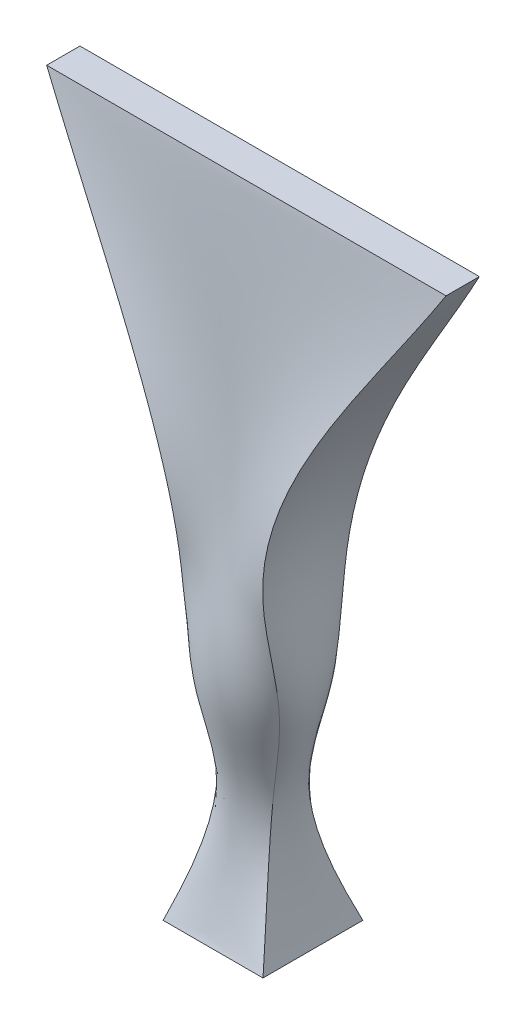
ISO-10303-21;
HEADER;
FILE_DESCRIPTION(('STEP AP214'),'2;1');
FILE_NAME('part.step','',(''),(''),'','','');
FILE_SCHEMA(('AUTOMOTIVE_DESIGN { 1 0 10303 214 1 1 1 1 }'));
ENDSEC;
DATA;
#1=APPLICATION_CONTEXT('core data for automotive mechanical design processes');
#2=APPLICATION_PROTOCOL_DEFINITION('international standard','automotive_design',2000,#1);
#3=PRODUCT_CONTEXT('',#1,'mechanical');
#4=PRODUCT('Part','Part','',(#3));
#5=PRODUCT_RELATED_PRODUCT_CATEGORY('part','',(#4));
#6=PRODUCT_DEFINITION_FORMATION('','',#4);
#7=PRODUCT_DEFINITION_CONTEXT('part definition',#1,'design');
#8=PRODUCT_DEFINITION('design','',#6,#7);
#9=PRODUCT_DEFINITION_SHAPE('','',#8);
#10=(LENGTH_UNIT() NAMED_UNIT(*) SI_UNIT(.MILLI.,.METRE.));
#11=(NAMED_UNIT(*) PLANE_ANGLE_UNIT() SI_UNIT($,.RADIAN.));
#12=(NAMED_UNIT(*) SI_UNIT($,.STERADIAN.) SOLID_ANGLE_UNIT());
#13=UNCERTAINTY_MEASURE_WITH_UNIT(LENGTH_MEASURE(1.E-05),#10,'distance_accuracy_value','');
#14=(GEOMETRIC_REPRESENTATION_CONTEXT(3) GLOBAL_UNCERTAINTY_ASSIGNED_CONTEXT((#13)) GLOBAL_UNIT_ASSIGNED_CONTEXT((#10,
#11,#12)) REPRESENTATION_CONTEXT('',''));
#15=CARTESIAN_POINT('',(0.,0.,0.));
#16=DIRECTION('',(0.,0.,1.));
#17=DIRECTION('',(1.,0.,0.));
#18=AXIS2_PLACEMENT_3D('',#15,#16,#17);
#19=CARTESIAN_POINT('',(0.,195.,0.));
#20=DIRECTION('',(0.,-1.,0.));
#21=DIRECTION('',(0.,0.,-1.));
#22=AXIS2_PLACEMENT_3D('',#19,#20,#21);
#23=PLANE('',#22);
#24=DIRECTION('',(0.,0.,1.));
#25=VECTOR('',#24,1.);
#26=CARTESIAN_POINT('',(-59.9999999999999,195.,-5.));
#27=LINE('',#26,#25);
#28=CARTESIAN_POINT('',(-59.9999999999999,195.,-5.));
#29=VERTEX_POINT('',#28);
#30=CARTESIAN_POINT('',(-59.9999999999999,195.,5.));
#31=VERTEX_POINT('',#30);
#32=EDGE_CURVE('E151',#29,#31,#27,.T.);
#33=ORIENTED_EDGE('',*,*,#32,.T.);
#34=DIRECTION('',(1.,0.,0.));
#35=VECTOR('',#34,1.);
#36=CARTESIAN_POINT('',(60.0000000000001,195.,4.99999999999999));
#37=LINE('',#36,#35);
#38=CARTESIAN_POINT('',(60.0000000000001,195.,4.99999999999999));
#39=VERTEX_POINT('',#38);
#40=EDGE_CURVE('E208',#31,#39,#37,.T.);
#41=ORIENTED_EDGE('',*,*,#40,.T.);
#42=DIRECTION('',(0.,0.,-1.));
#43=VECTOR('',#42,1.);
#44=CARTESIAN_POINT('',(60.,195.,-5.00000000000002));
#45=LINE('',#44,#43);
#46=CARTESIAN_POINT('',(60.,195.,-5.00000000000002));
#47=VERTEX_POINT('',#46);
#48=EDGE_CURVE('E89',#39,#47,#45,.T.);
#49=ORIENTED_EDGE('',*,*,#48,.T.);
#50=DIRECTION('',(-1.,0.,0.));
#51=VECTOR('',#50,1.);
#52=CARTESIAN_POINT('',(60.,195.,-5.00000000000002));
#53=LINE('',#52,#51);
#54=EDGE_CURVE('E12',#47,#29,#53,.T.);
#55=ORIENTED_EDGE('',*,*,#54,.T.);
#56=EDGE_LOOP('',(#33,#41,#49,#55));
#57=FACE_BOUND('',#56,.T.);
#58=ADVANCED_FACE('F79',(#57),#23,.F.);
#59=CARTESIAN_POINT('',(0.,0.,0.));
#60=DIRECTION('',(0.,-1.,0.));
#61=DIRECTION('',(0.,0.,-1.));
#62=AXIS2_PLACEMENT_3D('',#59,#60,#61);
#63=PLANE('',#62);
#64=DIRECTION('',(0.,0.,-1.));
#65=VECTOR('',#64,1.);
#66=CARTESIAN_POINT('',(15.,0.,15.));
#67=LINE('',#66,#65);
#68=CARTESIAN_POINT('',(15.,0.,15.));
#69=VERTEX_POINT('',#68);
#70=CARTESIAN_POINT('',(15.,0.,-15.));
#71=VERTEX_POINT('',#70);
#72=EDGE_CURVE('E146',#69,#71,#67,.T.);
#73=ORIENTED_EDGE('',*,*,#72,.F.);
#74=DIRECTION('',(1.,0.,0.));
#75=VECTOR('',#74,1.);
#76=CARTESIAN_POINT('',(-15.,0.,15.));
#77=LINE('',#76,#75);
#78=CARTESIAN_POINT('',(-15.,0.,15.));
#79=VERTEX_POINT('',#78);
#80=EDGE_CURVE('E131',#79,#69,#77,.T.);
#81=ORIENTED_EDGE('',*,*,#80,.F.);
#82=DIRECTION('',(0.,0.,1.));
#83=VECTOR('',#82,1.);
#84=CARTESIAN_POINT('',(-15.,0.,15.));
#85=LINE('',#84,#83);
#86=CARTESIAN_POINT('',(-15.,0.,-15.));
#87=VERTEX_POINT('',#86);
#88=EDGE_CURVE('E123',#87,#79,#85,.T.);
#89=ORIENTED_EDGE('',*,*,#88,.F.);
#90=DIRECTION('',(-1.,0.,0.));
#91=VECTOR('',#90,1.);
#92=CARTESIAN_POINT('',(-15.,0.,-15.));
#93=LINE('',#92,#91);
#94=EDGE_CURVE('E128',#71,#87,#93,.T.);
#95=ORIENTED_EDGE('',*,*,#94,.F.);
#96=EDGE_LOOP('',(#73,#81,#89,#95));
#97=FACE_BOUND('',#96,.T.);
#98=ADVANCED_FACE('F127',(#97),#63,.T.);
#99=CARTESIAN_POINT('',(-15.,0.,-15.));
#100=CARTESIAN_POINT('',(-11.1351009141226,13.0824918601515,-9.99821140632339));
#101=CARTESIAN_POINT('',(-4.92680858661205,35.0249951034119,-2.85911856405899));
#102=CARTESIAN_POINT('',(-15.0875542961324,66.4080288300102,-8.09073235974373));
#103=CARTESIAN_POINT('',(-6.33799108371792,121.397505103767,-18.07224902597));
#104=CARTESIAN_POINT('',(-40.8968219904277,162.893993649975,-9.22531624507669));
#105=CARTESIAN_POINT('',(-59.9999999999999,195.,-5.));
#106=CARTESIAN_POINT('',(-15.,0.,-5.));
#107=CARTESIAN_POINT('',(-11.1351009141226,13.0824918601515,-3.33273713544113));
#108=CARTESIAN_POINT('',(-6.52659984504941,35.0249951034119,-1.18169258984129));
#109=CARTESIAN_POINT('',(-19.1434182499601,66.4080288300102,-3.27660250168638));
#110=CARTESIAN_POINT('',(-1.54139378927669,121.397505103767,-5.33852063675826));
#111=CARTESIAN_POINT('',(-40.8968219904277,162.893993649975,-3.07510541502556));
#112=CARTESIAN_POINT('',(-59.9999999999999,195.,-1.66666666666667));
#113=CARTESIAN_POINT('',(-15.,0.,5.));
#114=CARTESIAN_POINT('',(-11.1351009141226,13.0824918601515,3.33273713544113));
#115=CARTESIAN_POINT('',(-6.52659984504941,35.0249951034119,1.18169258984129));
#116=CARTESIAN_POINT('',(-19.1434182499601,66.4080288300102,3.27660250168637));
#117=CARTESIAN_POINT('',(-1.54139378927667,121.397505103767,5.33852063675829));
#118=CARTESIAN_POINT('',(-40.8968219904277,162.893993649975,3.07510541502557));
#119=CARTESIAN_POINT('',(-59.9999999999999,195.,1.66666666666667));
#120=CARTESIAN_POINT('',(-15.,0.,15.));
#121=CARTESIAN_POINT('',(-11.1351009141226,13.0824918601515,9.99821140632339));
#122=CARTESIAN_POINT('',(-4.92680858661205,35.0249951034119,2.85911856405899));
#123=CARTESIAN_POINT('',(-15.0875542961324,66.4080288300102,8.09073235974372));
#124=CARTESIAN_POINT('',(-6.3379910837179,121.397505103767,18.07224902597));
#125=CARTESIAN_POINT('',(-40.8968219904277,162.893993649975,9.2253162450767));
#126=CARTESIAN_POINT('',(-59.9999999999999,195.,5.));
#127=B_SPLINE_SURFACE_WITH_KNOTS('',3,3,((#99,#100,#101,#102,#103,#104,#105),(#106,#107,#108,
#109,#110,#111,#112),(#113,#114,#115,#116,#117,#118,#119),(#120,#121,#122,#123,#124,#125,#126)),
.UNSPECIFIED.,.F.,.F.,.F.,(4,4),(4,1,1,1,4),(0.,1.),(0.,0.200023711538481,0.32442437302174,
0.471912533780948,1.),.UNSPECIFIED.);
#128=CARTESIAN_POINT('',(-15.,0.,15.));
#129=CARTESIAN_POINT('',(-11.1351009141226,13.0824918601515,9.99821140632339));
#130=CARTESIAN_POINT('',(-4.92680858661205,35.0249951034119,2.85911856405899));
#131=CARTESIAN_POINT('',(-15.0875542961324,66.4080288300102,8.09073235974372));
#132=CARTESIAN_POINT('',(-6.3379910837179,121.397505103767,18.07224902597));
#133=CARTESIAN_POINT('',(-40.8968219904277,162.893993649975,9.2253162450767));
#134=CARTESIAN_POINT('',(-59.9999999999999,195.,5.));
#135=B_SPLINE_CURVE_WITH_KNOTS('',3,(#128,#129,#130,#131,#132,#133,#134),.UNSPECIFIED.,.F.,.F.,
(4,1,1,1,4),(0.,0.200023711538481,0.32442437302174,0.471912533780948,1.),.UNSPECIFIED.);
#136=EDGE_CURVE('E153',#79,#31,#135,.T.);
#137=CARTESIAN_POINT('',(-15.,0.,-15.));
#138=CARTESIAN_POINT('',(-11.1351009141226,13.0824918601515,-9.99821140632339));
#139=CARTESIAN_POINT('',(-4.92680858661205,35.0249951034119,-2.85911856405899));
#140=CARTESIAN_POINT('',(-15.0875542961324,66.4080288300102,-8.09073235974373));
#141=CARTESIAN_POINT('',(-6.33799108371792,121.397505103767,-18.07224902597));
#142=CARTESIAN_POINT('',(-40.8968219904277,162.893993649975,-9.22531624507669));
#143=CARTESIAN_POINT('',(-59.9999999999999,195.,-5.));
#144=B_SPLINE_CURVE_WITH_KNOTS('',3,(#137,#138,#139,#140,#141,#142,#143),.UNSPECIFIED.,.F.,.F.,
(4,1,1,1,4),(0.,0.200023711538481,0.32442437302174,0.471912533780948,1.),.UNSPECIFIED.);
#145=EDGE_CURVE('E145',#29,#87,#144,.F.);
#146=ORIENTED_EDGE('',*,*,#88,.T.);
#147=ORIENTED_EDGE('',*,*,#136,.T.);
#148=ORIENTED_EDGE('',*,*,#32,.F.);
#149=ORIENTED_EDGE('',*,*,#145,.T.);
#150=EDGE_LOOP('',(#146,#147,#148,#149));
#151=FACE_BOUND('',#150,.T.);
#152=ADVANCED_FACE('F150',(#151),#127,.T.);
#153=CARTESIAN_POINT('',(-15.,0.,15.));
#154=CARTESIAN_POINT('',(-11.1351009141226,13.0824918601515,9.99821140632339));
#155=CARTESIAN_POINT('',(-4.92680858661205,35.0249951034119,2.85911856405899));
#156=CARTESIAN_POINT('',(-15.0875542961324,66.4080288300102,8.09073235974372));
#157=CARTESIAN_POINT('',(-6.33799108371791,121.397505103767,18.07224902597));
#158=CARTESIAN_POINT('',(-40.8968219904277,162.893993649975,9.2253162450767));
#159=CARTESIAN_POINT('',(-59.9999999999999,195.,5.));
#160=CARTESIAN_POINT('',(-13.75,0.,15.));
#161=CARTESIAN_POINT('',(-10.2777895299296,13.1271586577832,10.2394635494096));
#162=CARTESIAN_POINT('',(-4.69804686617371,35.0133638291985,3.37870917179));
#163=CARTESIAN_POINT('',(-14.3427088270155,66.4092301464946,9.58849177564515));
#164=CARTESIAN_POINT('',(-5.2175900154379,121.412399501266,16.3305204173973));
#165=CARTESIAN_POINT('',(-37.3623651734643,162.744633588834,8.95460576985166));
#166=CARTESIAN_POINT('',(-54.9999999999999,195.,5.));
#167=CARTESIAN_POINT('',(-11.25,0.,15.));
#168=CARTESIAN_POINT('',(-8.56316676154345,13.2164922530467,10.7219678355819));
#169=CARTESIAN_POINT('',(-4.10365993100532,34.9901012807719,4.30324303491097));
#170=CARTESIAN_POINT('',(-12.5060352995437,66.4116327794633,12.2933513971859));
#171=CARTESIAN_POINT('',(-3.38714083146782,121.442188296264,13.1908062837031));
#172=CARTESIAN_POINT('',(-30.2934515395374,162.445913466552,8.41318481940159));
#173=CARTESIAN_POINT('',(-45.,195.,5.));
#174=CARTESIAN_POINT('',(-7.5,0.,15.));
#175=CARTESIAN_POINT('',(-5.7980412747662,13.2862892044615,11.2462916348593));
#176=CARTESIAN_POINT('',(-2.92760062474981,34.9730059111258,5.35276433827132));
#177=CARTESIAN_POINT('',(-8.88855526020238,66.4110653153964,15.3474265785888));
#178=CARTESIAN_POINT('',(-1.62475115096946,121.488978814078,9.6390117219408));
#179=CARTESIAN_POINT('',(-20.0260663074876,162.023703791368,7.86340279787846));
#180=CARTESIAN_POINT('',(-30.,195.,5.));
#181=CARTESIAN_POINT('',(-3.75,0.,15.));
#182=CARTESIAN_POINT('',(-2.94212171716445,13.3257425868679,11.5868763153111));
#183=CARTESIAN_POINT('',(-1.54450143920986,34.9636421373699,6.01338025869181));
#184=CARTESIAN_POINT('',(-4.68044196324425,66.4100663968943,17.2779745696417));
#185=CARTESIAN_POINT('',(-0.541048451924081,121.521951081401,7.393852804563));
#186=CARTESIAN_POINT('',(-9.94008354563188,161.732667338296,7.51579638803695));
#187=CARTESIAN_POINT('',(-15.,195.,5.));
#188=CARTESIAN_POINT('',(0.,0.,15.));
#189=CARTESIAN_POINT('',(0.,13.3371287065661,11.7065618423445));
#190=CARTESIAN_POINT('',(0.,34.9610676657999,6.24774507772319));
#191=CARTESIAN_POINT('',(0.,66.4094885901917,17.9620903273628));
#192=CARTESIAN_POINT('',(0.,121.534251822422,6.5978248191012));
#193=CARTESIAN_POINT('',(0.,161.626313389676,7.3965135706874));
#194=CARTESIAN_POINT('',(0.,195.,4.99999999999999));
#195=CARTESIAN_POINT('',(3.75,0.,15.));
#196=CARTESIAN_POINT('',(2.94212171716445,13.3257425868679,11.5868763153111));
#197=CARTESIAN_POINT('',(1.54450143920987,34.9636421373699,6.01338025869177));
#198=CARTESIAN_POINT('',(4.68044196324422,66.4100663968942,17.2779745696418));
#199=CARTESIAN_POINT('',(0.541048451924123,121.521951081401,7.39385280456293));
#200=CARTESIAN_POINT('',(9.94008354563195,161.732667338296,7.51579638803695));
#201=CARTESIAN_POINT('',(15.0000000000001,195.,5.));
#202=CARTESIAN_POINT('',(7.5,0.,15.));
#203=CARTESIAN_POINT('',(5.79804127476619,13.2862892044615,11.2462916348593));
#204=CARTESIAN_POINT('',(2.92760062474978,34.9730059111258,5.35276433827133));
#205=CARTESIAN_POINT('',(8.88855526020241,66.4110653153966,15.3474265785888));
#206=CARTESIAN_POINT('',(1.62475115096942,121.488978814078,9.63901172194079));
#207=CARTESIAN_POINT('',(20.0260663074877,162.023703791368,7.86340279787843));
#208=CARTESIAN_POINT('',(30.0000000000001,195.,5.));
#209=CARTESIAN_POINT('',(11.25,0.,15.));
#210=CARTESIAN_POINT('',(8.56316676154345,13.2164922530467,10.7219678355819));
#211=CARTESIAN_POINT('',(4.10365993100533,34.9901012807719,4.303243034911));
#212=CARTESIAN_POINT('',(12.5060352995437,66.4116327794633,12.2933513971859));
#213=CARTESIAN_POINT('',(3.38714083146787,121.442188296264,13.1908062837032));
#214=CARTESIAN_POINT('',(30.2934515395375,162.445913466553,8.41318481940158));
#215=CARTESIAN_POINT('',(45.0000000000001,195.,4.99999999999999));
#216=CARTESIAN_POINT('',(13.75,0.,15.));
#217=CARTESIAN_POINT('',(10.2777895299296,13.1271586577832,10.2394635494096));
#218=CARTESIAN_POINT('',(4.69804686617371,35.0133638291985,3.37870917179));
#219=CARTESIAN_POINT('',(14.3427088270154,66.4092301464946,9.58849177564517));
#220=CARTESIAN_POINT('',(5.21759001543791,121.412399501266,16.3305204173972));
#221=CARTESIAN_POINT('',(37.3623651734643,162.744633588834,8.95460576985165));
#222=CARTESIAN_POINT('',(55.,195.,4.99999999999999));
#223=CARTESIAN_POINT('',(15.,0.,15.));
#224=CARTESIAN_POINT('',(11.1351009141226,13.0824918601515,9.99821140632339));
#225=CARTESIAN_POINT('',(4.92680858661205,35.0249951034119,2.85911856405899));
#226=CARTESIAN_POINT('',(15.0875542961324,66.4080288300102,8.09073235974373));
#227=CARTESIAN_POINT('',(6.33799108371791,121.397505103767,18.07224902597));
#228=CARTESIAN_POINT('',(40.8968219904278,162.893993649975,9.22531624507668));
#229=CARTESIAN_POINT('',(60.0000000000001,195.,4.99999999999999));
#230=B_SPLINE_SURFACE_WITH_KNOTS('',3,3,((#153,#154,#155,#156,#157,#158,#159),(#160,#161,#162,
#163,#164,#165,#166),(#167,#168,#169,#170,#171,#172,#173),(#174,#175,#176,#177,#178,#179,#180),
(#181,#182,#183,#184,#185,#186,#187),(#188,#189,#190,#191,#192,#193,#194),(#195,#196,#197,#198,
#199,#200,#201),(#202,#203,#204,#205,#206,#207,#208),(#209,#210,#211,#212,#213,#214,#215),(#216,
#217,#218,#219,#220,#221,#222),(#223,#224,#225,#226,#227,#228,#229)),.UNSPECIFIED.,.F.,.F.,.F.,
(4,1,1,1,1,1,1,1,4),(4,1,1,1,4),(0.,0.125,0.25,0.375,0.5,0.625,0.75,0.875,1.),(0.,
0.200023711538481,0.32442437302174,0.471912533780948,1.),.UNSPECIFIED.);
#231=CARTESIAN_POINT('',(15.,0.,15.));
#232=CARTESIAN_POINT('',(11.1351009141226,13.0824918601515,9.99821140632339));
#233=CARTESIAN_POINT('',(4.92680858661205,35.0249951034119,2.85911856405899));
#234=CARTESIAN_POINT('',(15.0875542961324,66.4080288300102,8.09073235974373));
#235=CARTESIAN_POINT('',(6.33799108371791,121.397505103767,18.07224902597));
#236=CARTESIAN_POINT('',(40.8968219904278,162.893993649975,9.22531624507668));
#237=CARTESIAN_POINT('',(60.0000000000001,195.,4.99999999999999));
#238=B_SPLINE_CURVE_WITH_KNOTS('',3,(#231,#232,#233,#234,#235,#236,#237),.UNSPECIFIED.,.F.,.F.,
(4,1,1,1,4),(0.,0.200023711538481,0.32442437302174,0.471912533780948,1.),.UNSPECIFIED.);
#239=EDGE_CURVE('E155',#69,#39,#238,.T.);
#240=ORIENTED_EDGE('',*,*,#80,.T.);
#241=ORIENTED_EDGE('',*,*,#239,.T.);
#242=ORIENTED_EDGE('',*,*,#40,.F.);
#243=ORIENTED_EDGE('',*,*,#136,.F.);
#244=EDGE_LOOP('',(#240,#241,#242,#243));
#245=FACE_BOUND('',#244,.T.);
#246=ADVANCED_FACE('F184',(#245),#230,.T.);
#247=CARTESIAN_POINT('',(15.,0.,-15.));
#248=CARTESIAN_POINT('',(11.1351009141226,13.0824918601515,-9.99821140632339));
#249=CARTESIAN_POINT('',(4.92680858661205,35.0249951034119,-2.85911856405899));
#250=CARTESIAN_POINT('',(15.0875542961324,66.4080288300102,-8.09073235974372));
#251=CARTESIAN_POINT('',(6.3379910837179,121.397505103767,-18.07224902597));
#252=CARTESIAN_POINT('',(40.8968219904278,162.893993649975,-9.2253162450767));
#253=CARTESIAN_POINT('',(60.,195.,-5.00000000000002));
#254=CARTESIAN_POINT('',(13.75,0.,-15.));
#255=CARTESIAN_POINT('',(10.2777895299296,13.1271586577832,-10.2394635494096));
#256=CARTESIAN_POINT('',(4.69804686617371,35.0133638291985,-3.37870917179));
#257=CARTESIAN_POINT('',(14.3427088270154,66.4092301464946,-9.58849177564516));
#258=CARTESIAN_POINT('',(5.2175900154379,121.412399501266,-16.3305204173973));
#259=CARTESIAN_POINT('',(37.3623651734643,162.744633588834,-8.95460576985166));
#260=CARTESIAN_POINT('',(55.,195.,-5.00000000000002));
#261=CARTESIAN_POINT('',(11.25,0.,-15.));
#262=CARTESIAN_POINT('',(8.56316676154345,13.2164922530467,-10.7219678355819));
#263=CARTESIAN_POINT('',(4.10365993100532,34.9901012807719,-4.303243034911));
#264=CARTESIAN_POINT('',(12.5060352995437,66.4116327794633,-12.2933513971859));
#265=CARTESIAN_POINT('',(3.38714083146782,121.442188296264,-13.1908062837031));
#266=CARTESIAN_POINT('',(30.2934515395374,162.445913466552,-8.41318481940159));
#267=CARTESIAN_POINT('',(45.,195.,-5.00000000000002));
#268=CARTESIAN_POINT('',(7.5,0.,-15.));
#269=CARTESIAN_POINT('',(5.7980412747662,13.2862892044615,-11.2462916348593));
#270=CARTESIAN_POINT('',(2.92760062474981,34.9730059111258,-5.3527643382713));
#271=CARTESIAN_POINT('',(8.88855526020238,66.4110653153964,-15.3474265785888));
#272=CARTESIAN_POINT('',(1.62475115096945,121.488978814078,-9.63901172194078));
#273=CARTESIAN_POINT('',(20.0260663074877,162.023703791368,-7.86340279787845));
#274=CARTESIAN_POINT('',(30.0000000000001,195.,-5.00000000000002));
#275=CARTESIAN_POINT('',(3.75,0.,-15.));
#276=CARTESIAN_POINT('',(2.94212171716445,13.3257425868679,-11.5868763153111));
#277=CARTESIAN_POINT('',(1.54450143920986,34.9636421373699,-6.01338025869183));
#278=CARTESIAN_POINT('',(4.68044196324425,66.4100663968943,-17.2779745696417));
#279=CARTESIAN_POINT('',(0.54104845192408,121.521951081401,-7.393852804563));
#280=CARTESIAN_POINT('',(9.94008354563192,161.732667338296,-7.51579638803696));
#281=CARTESIAN_POINT('',(15.0000000000001,195.,-5.00000000000001));
#282=CARTESIAN_POINT('',(0.,0.,-15.));
#283=CARTESIAN_POINT('',(0.,13.3371287065661,-11.7065618423444));
#284=CARTESIAN_POINT('',(0.,34.9610676657999,-6.24774507772318));
#285=CARTESIAN_POINT('',(0.,66.4094885901917,-17.9620903273628));
#286=CARTESIAN_POINT('',(0.,121.534251822422,-6.59782481910119));
#287=CARTESIAN_POINT('',(0.,161.626313389676,-7.39651357068741));
#288=CARTESIAN_POINT('',(0.,195.,-5.00000000000001));
#289=CARTESIAN_POINT('',(-3.75,0.,-15.));
#290=CARTESIAN_POINT('',(-2.94212171716445,13.3257425868679,-11.5868763153111));
#291=CARTESIAN_POINT('',(-1.54450143920988,34.9636421373699,-6.01338025869179));
#292=CARTESIAN_POINT('',(-4.68044196324422,66.4100663968942,-17.2779745696417));
#293=CARTESIAN_POINT('',(-0.54104845192412,121.521951081401,-7.39385280456294));
#294=CARTESIAN_POINT('',(-9.94008354563189,161.732667338296,-7.51579638803695));
#295=CARTESIAN_POINT('',(-15.,195.,-5.00000000000001));
#296=CARTESIAN_POINT('',(-7.5,0.,-15.));
#297=CARTESIAN_POINT('',(-5.79804127476618,13.2862892044615,-11.2462916348593));
#298=CARTESIAN_POINT('',(-2.92760062474978,34.9730059111258,-5.35276433827131));
#299=CARTESIAN_POINT('',(-8.8885552602024,66.4110653153966,-15.3474265785888));
#300=CARTESIAN_POINT('',(-1.62475115096944,121.488978814078,-9.63901172194078));
#301=CARTESIAN_POINT('',(-20.0260663074876,162.023703791368,-7.86340279787845));
#302=CARTESIAN_POINT('',(-30.,195.,-5.00000000000001));
#303=CARTESIAN_POINT('',(-11.25,0.,-15.));
#304=CARTESIAN_POINT('',(-8.56316676154346,13.2164922530467,-10.721967835582));
#305=CARTESIAN_POINT('',(-4.10365993100534,34.9901012807719,-4.303243034911));
#306=CARTESIAN_POINT('',(-12.5060352995437,66.4116327794633,-12.2933513971859));
#307=CARTESIAN_POINT('',(-3.38714083146788,121.442188296264,-13.1908062837032));
#308=CARTESIAN_POINT('',(-30.2934515395374,162.445913466553,-8.41318481940159));
#309=CARTESIAN_POINT('',(-45.,195.,-5.00000000000001));
#310=CARTESIAN_POINT('',(-13.75,0.,-15.));
#311=CARTESIAN_POINT('',(-10.2777895299296,13.1271586577832,-10.2394635494096));
#312=CARTESIAN_POINT('',(-4.69804686617371,35.0133638291985,-3.37870917179));
#313=CARTESIAN_POINT('',(-14.3427088270154,66.4092301464946,-9.58849177564516));
#314=CARTESIAN_POINT('',(-5.21759001543792,121.412399501266,-16.3305204173973));
#315=CARTESIAN_POINT('',(-37.3623651734643,162.744633588834,-8.95460576985165));
#316=CARTESIAN_POINT('',(-55.,195.,-5.));
#317=CARTESIAN_POINT('',(-15.,0.,-15.));
#318=CARTESIAN_POINT('',(-11.1351009141226,13.0824918601515,-9.99821140632339));
#319=CARTESIAN_POINT('',(-4.92680858661205,35.0249951034119,-2.85911856405899));
#320=CARTESIAN_POINT('',(-15.0875542961324,66.4080288300102,-8.09073235974373));
#321=CARTESIAN_POINT('',(-6.33799108371791,121.397505103767,-18.07224902597));
#322=CARTESIAN_POINT('',(-40.8968219904277,162.893993649975,-9.22531624507669));
#323=CARTESIAN_POINT('',(-60.,195.,-5.));
#324=B_SPLINE_SURFACE_WITH_KNOTS('',3,3,((#247,#248,#249,#250,#251,#252,#253),(#254,#255,#256,
#257,#258,#259,#260),(#261,#262,#263,#264,#265,#266,#267),(#268,#269,#270,#271,#272,#273,#274),
(#275,#276,#277,#278,#279,#280,#281),(#282,#283,#284,#285,#286,#287,#288),(#289,#290,#291,#292,
#293,#294,#295),(#296,#297,#298,#299,#300,#301,#302),(#303,#304,#305,#306,#307,#308,#309),(#310,
#311,#312,#313,#314,#315,#316),(#317,#318,#319,#320,#321,#322,#323)),.UNSPECIFIED.,.F.,.F.,.F.,
(4,1,1,1,1,1,1,1,4),(4,1,1,1,4),(0.,0.125,0.25,0.375,0.5,0.625,0.75,0.875,1.),(0.,
0.200023711538481,0.32442437302174,0.471912533780948,1.),.UNSPECIFIED.);
#325=CARTESIAN_POINT('',(15.,0.,-15.));
#326=CARTESIAN_POINT('',(11.1351009141226,13.0824918601515,-9.9982114063234));
#327=CARTESIAN_POINT('',(4.92680858661205,35.0249951034119,-2.85911856405899));
#328=CARTESIAN_POINT('',(15.0875542961324,66.4080288300102,-8.09073235974372));
#329=CARTESIAN_POINT('',(6.3379910837179,121.397505103767,-18.07224902597));
#330=CARTESIAN_POINT('',(40.8968219904278,162.893993649975,-9.2253162450767));
#331=CARTESIAN_POINT('',(60.,195.,-5.00000000000002));
#332=B_SPLINE_CURVE_WITH_KNOTS('',3,(#325,#326,#327,#328,#329,#330,#331),.UNSPECIFIED.,.F.,.F.,
(4,1,1,1,4),(0.,0.200023711538481,0.32442437302174,0.471912533780948,1.),.UNSPECIFIED.);
#333=EDGE_CURVE('E104',#71,#47,#332,.T.);
#334=ORIENTED_EDGE('',*,*,#94,.T.);
#335=ORIENTED_EDGE('',*,*,#145,.F.);
#336=ORIENTED_EDGE('',*,*,#54,.F.);
#337=ORIENTED_EDGE('',*,*,#333,.F.);
#338=EDGE_LOOP('',(#334,#335,#336,#337));
#339=FACE_BOUND('',#338,.T.);
#340=ADVANCED_FACE('F144',(#339),#324,.T.);
#341=CARTESIAN_POINT('',(15.,0.,15.));
#342=CARTESIAN_POINT('',(11.1351009141226,13.0824918601515,9.99821140632339));
#343=CARTESIAN_POINT('',(4.92680858661205,35.0249951034119,2.85911856405899));
#344=CARTESIAN_POINT('',(15.0875542961324,66.4080288300102,8.09073235974372));
#345=CARTESIAN_POINT('',(6.3379910837179,121.397505103767,18.07224902597));
#346=CARTESIAN_POINT('',(40.8968219904278,162.893993649975,9.22531624507669));
#347=CARTESIAN_POINT('',(60.0000000000001,195.,4.99999999999999));
#348=CARTESIAN_POINT('',(15.,0.,5.));
#349=CARTESIAN_POINT('',(11.1351009141226,13.0824918601515,3.33273713544113));
#350=CARTESIAN_POINT('',(6.52659984504941,35.0249951034119,1.18169258984129));
#351=CARTESIAN_POINT('',(19.1434182499601,66.4080288300102,3.27660250168637));
#352=CARTESIAN_POINT('',(1.54139378927667,121.397505103767,5.33852063675828));
#353=CARTESIAN_POINT('',(40.8968219904278,162.893993649975,3.07510541502556));
#354=CARTESIAN_POINT('',(60.0000000000001,195.,1.66666666666665));
#355=CARTESIAN_POINT('',(15.,0.,-5.));
#356=CARTESIAN_POINT('',(11.1351009141226,13.0824918601515,-3.33273713544113));
#357=CARTESIAN_POINT('',(6.52659984504942,35.0249951034119,-1.18169258984129));
#358=CARTESIAN_POINT('',(19.1434182499601,66.4080288300102,-3.27660250168637));
#359=CARTESIAN_POINT('',(1.54139378927667,121.397505103767,-5.33852063675827));
#360=CARTESIAN_POINT('',(40.8968219904278,162.893993649975,-3.07510541502557));
#361=CARTESIAN_POINT('',(60.0000000000001,195.,-1.66666666666668));
#362=CARTESIAN_POINT('',(15.,0.,-15.));
#363=CARTESIAN_POINT('',(11.1351009141226,13.0824918601515,-9.9982114063234));
#364=CARTESIAN_POINT('',(4.92680858661205,35.0249951034119,-2.85911856405899));
#365=CARTESIAN_POINT('',(15.0875542961324,66.4080288300102,-8.09073235974372));
#366=CARTESIAN_POINT('',(6.3379910837179,121.397505103767,-18.07224902597));
#367=CARTESIAN_POINT('',(40.8968219904278,162.893993649975,-9.2253162450767));
#368=CARTESIAN_POINT('',(60.,195.,-5.00000000000002));
#369=B_SPLINE_SURFACE_WITH_KNOTS('',3,3,((#341,#342,#343,#344,#345,#346,#347),(#348,#349,#350,
#351,#352,#353,#354),(#355,#356,#357,#358,#359,#360,#361),(#362,#363,#364,#365,#366,#367,#368)),
.UNSPECIFIED.,.F.,.F.,.F.,(4,4),(4,1,1,1,4),(0.,1.),(0.,0.200023711538481,0.32442437302174,
0.471912533780948,1.),.UNSPECIFIED.);
#370=ORIENTED_EDGE('',*,*,#72,.T.);
#371=ORIENTED_EDGE('',*,*,#333,.T.);
#372=ORIENTED_EDGE('',*,*,#48,.F.);
#373=ORIENTED_EDGE('',*,*,#239,.F.);
#374=EDGE_LOOP('',(#370,#371,#372,#373));
#375=FACE_BOUND('',#374,.T.);
#376=ADVANCED_FACE('F223',(#375),#369,.T.);
#377=CLOSED_SHELL('',(#58,#98,#152,#246,#340,#376));
#378=MANIFOLD_SOLID_BREP('B2',#377);
#379=ADVANCED_BREP_SHAPE_REPRESENTATION('',(#18,#378),#14);
#380=SHAPE_DEFINITION_REPRESENTATION(#9,#379);
ENDSEC;
END-ISO-10303-21;
